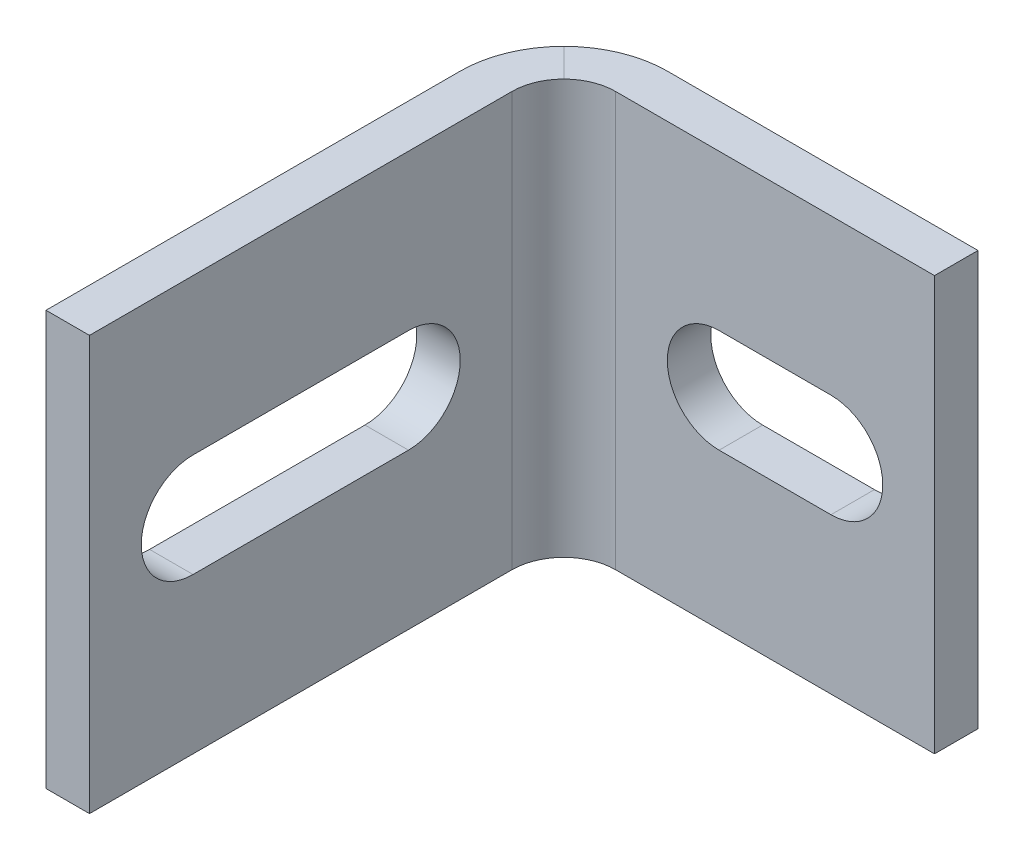
ISO-10303-21;
HEADER;
FILE_DESCRIPTION(('STEP AP214'),'2;1');
FILE_NAME('part.step','',(''),(''),'','','');
FILE_SCHEMA(('AUTOMOTIVE_DESIGN { 1 0 10303 214 1 1 1 1 }'));
ENDSEC;
DATA;
#1=APPLICATION_CONTEXT('core data for automotive mechanical design processes');
#2=APPLICATION_PROTOCOL_DEFINITION('international standard','automotive_design',2000,#1);
#3=PRODUCT_CONTEXT('',#1,'mechanical');
#4=PRODUCT('Part','Part','',(#3));
#5=PRODUCT_RELATED_PRODUCT_CATEGORY('part','',(#4));
#6=PRODUCT_DEFINITION_FORMATION('','',#4);
#7=PRODUCT_DEFINITION_CONTEXT('part definition',#1,'design');
#8=PRODUCT_DEFINITION('design','',#6,#7);
#9=PRODUCT_DEFINITION_SHAPE('','',#8);
#10=(LENGTH_UNIT() NAMED_UNIT(*) SI_UNIT(.MILLI.,.METRE.));
#11=(NAMED_UNIT(*) PLANE_ANGLE_UNIT() SI_UNIT($,.RADIAN.));
#12=(NAMED_UNIT(*) SI_UNIT($,.STERADIAN.) SOLID_ANGLE_UNIT());
#13=UNCERTAINTY_MEASURE_WITH_UNIT(LENGTH_MEASURE(1.E-05),#10,'distance_accuracy_value','');
#14=(GEOMETRIC_REPRESENTATION_CONTEXT(3) GLOBAL_UNCERTAINTY_ASSIGNED_CONTEXT((#13)) GLOBAL_UNIT_ASSIGNED_CONTEXT((#10,
#11,#12)) REPRESENTATION_CONTEXT('',''));
#15=CARTESIAN_POINT('',(0.,0.,0.));
#16=DIRECTION('',(0.,0.,1.));
#17=DIRECTION('',(1.,0.,0.));
#18=AXIS2_PLACEMENT_3D('',#15,#16,#17);
#19=CARTESIAN_POINT('',(0.,-12.7,0.));
#20=DIRECTION('',(1.,0.,0.));
#21=DIRECTION('',(0.,1.,0.));
#22=AXIS2_PLACEMENT_3D('',#19,#20,#21);
#23=PLANE('',#22);
#24=DIRECTION('',(0.,0.,-1.));
#25=VECTOR('',#24,1.);
#26=CARTESIAN_POINT('',(0.,12.7,-1.11022302462516E-13));
#27=LINE('',#26,#25);
#28=CARTESIAN_POINT('',(0.,12.7,-1.11022302462516E-13));
#29=VERTEX_POINT('',#28);
#30=CARTESIAN_POINT('',(0.,12.7000000000001,-25.4000000000001));
#31=VERTEX_POINT('',#30);
#32=EDGE_CURVE('E234',#29,#31,#27,.T.);
#33=ORIENTED_EDGE('',*,*,#32,.T.);
#34=DIRECTION('',(0.,-1.,0.));
#35=VECTOR('',#34,1.);
#36=CARTESIAN_POINT('',(0.,-12.7,-25.4));
#37=LINE('',#36,#35);
#38=CARTESIAN_POINT('',(0.,-12.7,-25.4));
#39=VERTEX_POINT('',#38);
#40=EDGE_CURVE('E289',#31,#39,#37,.T.);
#41=ORIENTED_EDGE('',*,*,#40,.T.);
#42=DIRECTION('',(0.,0.,-1.));
#43=VECTOR('',#42,1.);
#44=CARTESIAN_POINT('',(0.,-12.7,0.));
#45=LINE('',#44,#43);
#46=CARTESIAN_POINT('',(0.,-12.7,0.));
#47=VERTEX_POINT('',#46);
#48=EDGE_CURVE('E231',#47,#39,#45,.T.);
#49=ORIENTED_EDGE('',*,*,#48,.F.);
#50=DIRECTION('',(0.,-1.,0.));
#51=VECTOR('',#50,1.);
#52=CARTESIAN_POINT('',(0.,-12.7,0.));
#53=LINE('',#52,#51);
#54=EDGE_CURVE('E229',#29,#47,#53,.T.);
#55=ORIENTED_EDGE('',*,*,#54,.F.);
#56=EDGE_LOOP('',(#33,#41,#49,#55));
#57=FACE_BOUND('',#56,.T.);
#58=CARTESIAN_POINT('',(0.,0.,-19.558));
#59=DIRECTION('',(1.,0.,0.));
#60=DIRECTION('',(0.,0.,-1.));
#61=AXIS2_PLACEMENT_3D('',#58,#59,#60);
#62=CIRCLE('',#61,3.175);
#63=CARTESIAN_POINT('',(0.,-3.17499999999998,-19.558));
#64=VERTEX_POINT('',#63);
#65=CARTESIAN_POINT('',(0.,3.17500000000001,-19.558));
#66=VERTEX_POINT('',#65);
#67=EDGE_CURVE('E201',#64,#66,#62,.T.);
#68=ORIENTED_EDGE('',*,*,#67,.T.);
#69=DIRECTION('',(0.,0.,1.));
#70=VECTOR('',#69,1.);
#71=CARTESIAN_POINT('',(0.,3.17500000000001,-19.558));
#72=LINE('',#71,#70);
#73=CARTESIAN_POINT('',(0.,3.17500000000001,-6.34999999999997));
#74=VERTEX_POINT('',#73);
#75=EDGE_CURVE('E204',#66,#74,#72,.T.);
#76=ORIENTED_EDGE('',*,*,#75,.T.);
#77=CARTESIAN_POINT('',(0.,0.,-6.34999999999997));
#78=DIRECTION('',(1.,0.,0.));
#79=DIRECTION('',(0.,0.,-1.));
#80=AXIS2_PLACEMENT_3D('',#77,#78,#79);
#81=CIRCLE('',#80,3.175);
#82=CARTESIAN_POINT('',(0.,-3.17499999999998,-6.34999999999997));
#83=VERTEX_POINT('',#82);
#84=EDGE_CURVE('E207',#74,#83,#81,.T.);
#85=ORIENTED_EDGE('',*,*,#84,.T.);
#86=DIRECTION('',(0.,0.,-1.));
#87=VECTOR('',#86,1.);
#88=CARTESIAN_POINT('',(0.,-3.17499999999998,-19.558));
#89=LINE('',#88,#87);
#90=EDGE_CURVE('E210',#83,#64,#89,.T.);
#91=ORIENTED_EDGE('',*,*,#90,.T.);
#92=EDGE_LOOP('',(#68,#76,#85,#91));
#93=FACE_BOUND('',#92,.T.);
#94=ADVANCED_FACE('F32',(#57,#93),#23,.F.);
#95=CARTESIAN_POINT('',(2.66699999999997,-12.7,0.));
#96=DIRECTION('',(-1.,0.,0.));
#97=DIRECTION('',(0.,-1.,0.));
#98=AXIS2_PLACEMENT_3D('',#95,#96,#97);
#99=PLANE('',#98);
#100=DIRECTION('',(0.,0.,-1.));
#101=VECTOR('',#100,1.);
#102=CARTESIAN_POINT('',(2.66699999999997,-12.7,0.));
#103=LINE('',#102,#101);
#104=CARTESIAN_POINT('',(2.66699999999997,-12.7,0.));
#105=VERTEX_POINT('',#104);
#106=CARTESIAN_POINT('',(2.66699999999997,-12.7,-25.908));
#107=VERTEX_POINT('',#106);
#108=EDGE_CURVE('E230',#105,#107,#103,.T.);
#109=ORIENTED_EDGE('',*,*,#108,.T.);
#110=DIRECTION('',(0.,-1.,0.));
#111=VECTOR('',#110,1.);
#112=CARTESIAN_POINT('',(2.66699999999997,12.7,-25.908));
#113=LINE('',#112,#111);
#114=CARTESIAN_POINT('',(2.66699999999997,12.7,-25.908));
#115=VERTEX_POINT('',#114);
#116=EDGE_CURVE('E277',#107,#115,#113,.F.);
#117=ORIENTED_EDGE('',*,*,#116,.T.);
#118=DIRECTION('',(0.,0.,-1.));
#119=VECTOR('',#118,1.);
#120=CARTESIAN_POINT('',(2.66699999999997,12.7,-1.11022302462516E-13));
#121=LINE('',#120,#119);
#122=CARTESIAN_POINT('',(2.66699999999997,12.7,-1.11022302462516E-13));
#123=VERTEX_POINT('',#122);
#124=EDGE_CURVE('E241',#123,#115,#121,.T.);
#125=ORIENTED_EDGE('',*,*,#124,.F.);
#126=DIRECTION('',(0.,1.,0.));
#127=VECTOR('',#126,1.);
#128=CARTESIAN_POINT('',(2.66699999999997,-12.7,0.));
#129=LINE('',#128,#127);
#130=EDGE_CURVE('E244',#105,#123,#129,.T.);
#131=ORIENTED_EDGE('',*,*,#130,.F.);
#132=EDGE_LOOP('',(#109,#117,#125,#131));
#133=FACE_BOUND('',#132,.T.);
#134=CARTESIAN_POINT('',(2.66699999999997,0.,-19.558));
#135=DIRECTION('',(-1.,0.,0.));
#136=DIRECTION('',(0.,-1.,0.));
#137=AXIS2_PLACEMENT_3D('',#134,#135,#136);
#138=CIRCLE('',#137,3.175);
#139=CARTESIAN_POINT('',(2.66699999999997,3.17500000000001,-19.558));
#140=VERTEX_POINT('',#139);
#141=CARTESIAN_POINT('',(2.66699999999997,-3.17499999999998,-19.558));
#142=VERTEX_POINT('',#141);
#143=EDGE_CURVE('E198',#140,#142,#138,.T.);
#144=ORIENTED_EDGE('',*,*,#143,.T.);
#145=DIRECTION('',(0.,0.,1.));
#146=VECTOR('',#145,1.);
#147=CARTESIAN_POINT('',(2.66699999999997,-3.17499999999998,-19.558));
#148=LINE('',#147,#146);
#149=CARTESIAN_POINT('',(2.66699999999997,-3.17499999999998,-6.34999999999997));
#150=VERTEX_POINT('',#149);
#151=EDGE_CURVE('E222',#142,#150,#148,.T.);
#152=ORIENTED_EDGE('',*,*,#151,.T.);
#153=CARTESIAN_POINT('',(2.66699999999997,0.,-6.34999999999997));
#154=DIRECTION('',(-1.,0.,0.));
#155=DIRECTION('',(0.,-1.,0.));
#156=AXIS2_PLACEMENT_3D('',#153,#154,#155);
#157=CIRCLE('',#156,3.175);
#158=CARTESIAN_POINT('',(2.66699999999997,3.17500000000001,-6.34999999999997));
#159=VERTEX_POINT('',#158);
#160=EDGE_CURVE('E189',#150,#159,#157,.T.);
#161=ORIENTED_EDGE('',*,*,#160,.T.);
#162=DIRECTION('',(0.,0.,-1.));
#163=VECTOR('',#162,1.);
#164=CARTESIAN_POINT('',(2.66699999999997,3.17500000000001,-19.558));
#165=LINE('',#164,#163);
#166=EDGE_CURVE('E195',#159,#140,#165,.T.);
#167=ORIENTED_EDGE('',*,*,#166,.T.);
#168=EDGE_LOOP('',(#144,#152,#161,#167));
#169=FACE_BOUND('',#168,.T.);
#170=ADVANCED_FACE('F340',(#133,#169),#99,.F.);
#171=CARTESIAN_POINT('',(25.4,0.,-31.7499999999999));
#172=DIRECTION('',(-1.,0.,0.));
#173=DIRECTION('',(0.,0.,1.));
#174=AXIS2_PLACEMENT_3D('',#171,#172,#173);
#175=PLANE('',#174);
#176=DIRECTION('',(0.,1.,0.));
#177=VECTOR('',#176,1.);
#178=CARTESIAN_POINT('',(25.4,-12.7000000000001,-29.0830000000001));
#179=LINE('',#178,#177);
#180=CARTESIAN_POINT('',(25.4,-12.7000000000001,-29.0830000000001));
#181=VERTEX_POINT('',#180);
#182=CARTESIAN_POINT('',(25.4,12.7,-29.0830000000001));
#183=VERTEX_POINT('',#182);
#184=EDGE_CURVE('E270',#181,#183,#179,.T.);
#185=ORIENTED_EDGE('',*,*,#184,.F.);
#186=DIRECTION('',(0.,0.,1.));
#187=VECTOR('',#186,1.);
#188=CARTESIAN_POINT('',(25.4,-12.7000000000001,-29.0830000000001));
#189=LINE('',#188,#187);
#190=CARTESIAN_POINT('',(25.4,-12.7,-31.7500000000001));
#191=VERTEX_POINT('',#190);
#192=EDGE_CURVE('E225',#191,#181,#189,.T.);
#193=ORIENTED_EDGE('',*,*,#192,.F.);
#194=DIRECTION('',(0.,-1.,0.));
#195=VECTOR('',#194,1.);
#196=CARTESIAN_POINT('',(25.4,-12.7,-31.7500000000001));
#197=LINE('',#196,#195);
#198=CARTESIAN_POINT('',(25.4,12.7,-31.7500000000001));
#199=VERTEX_POINT('',#198);
#200=EDGE_CURVE('E261',#199,#191,#197,.T.);
#201=ORIENTED_EDGE('',*,*,#200,.F.);
#202=DIRECTION('',(0.,0.,-1.));
#203=VECTOR('',#202,1.);
#204=CARTESIAN_POINT('',(25.4,12.7,-29.0830000000001));
#205=LINE('',#204,#203);
#206=EDGE_CURVE('E266',#183,#199,#205,.T.);
#207=ORIENTED_EDGE('',*,*,#206,.F.);
#208=EDGE_LOOP('',(#185,#193,#201,#207));
#209=FACE_BOUND('',#208,.T.);
#210=ADVANCED_FACE('F336',(#209),#175,.F.);
#211=CARTESIAN_POINT('',(0.,0.,0.));
#212=DIRECTION('',(0.,0.,1.));
#213=DIRECTION('',(1.,0.,0.));
#214=AXIS2_PLACEMENT_3D('',#211,#212,#213);
#215=PLANE('',#214);
#216=ORIENTED_EDGE('',*,*,#130,.T.);
#217=DIRECTION('',(-1.,0.,0.));
#218=VECTOR('',#217,1.);
#219=CARTESIAN_POINT('',(2.66699999999997,12.7,-1.11022302462516E-13));
#220=LINE('',#219,#218);
#221=EDGE_CURVE('E238',#123,#29,#220,.T.);
#222=ORIENTED_EDGE('',*,*,#221,.T.);
#223=ORIENTED_EDGE('',*,*,#54,.T.);
#224=DIRECTION('',(1.,0.,0.));
#225=VECTOR('',#224,1.);
#226=CARTESIAN_POINT('',(2.66699999999997,-12.7,0.));
#227=LINE('',#226,#225);
#228=EDGE_CURVE('E226',#47,#105,#227,.T.);
#229=ORIENTED_EDGE('',*,*,#228,.T.);
#230=EDGE_LOOP('',(#216,#222,#223,#229));
#231=FACE_BOUND('',#230,.T.);
#232=ADVANCED_FACE('F319',(#231),#215,.T.);
#233=CARTESIAN_POINT('',(0.,-12.7,-29.083));
#234=DIRECTION('',(0.,0.,-1.));
#235=DIRECTION('',(0.,1.,0.));
#236=AXIS2_PLACEMENT_3D('',#233,#234,#235);
#237=PLANE('',#236);
#238=DIRECTION('',(1.,0.,0.));
#239=VECTOR('',#238,1.);
#240=CARTESIAN_POINT('',(12.192,-3.17500000000007,-29.083));
#241=LINE('',#240,#239);
#242=CARTESIAN_POINT('',(12.192,-3.17500000000007,-29.083));
#243=VERTEX_POINT('',#242);
#244=CARTESIAN_POINT('',(19.05,-3.17500000000004,-29.083));
#245=VERTEX_POINT('',#244);
#246=EDGE_CURVE('E183',#243,#245,#241,.T.);
#247=ORIENTED_EDGE('',*,*,#246,.F.);
#248=CARTESIAN_POINT('',(12.192,0.,-29.083));
#249=DIRECTION('',(0.,0.,1.));
#250=DIRECTION('',(1.,0.,0.));
#251=AXIS2_PLACEMENT_3D('',#248,#249,#250);
#252=CIRCLE('',#251,3.175);
#253=CARTESIAN_POINT('',(12.192,3.17499999999996,-29.083));
#254=VERTEX_POINT('',#253);
#255=EDGE_CURVE('E47',#254,#243,#252,.T.);
#256=ORIENTED_EDGE('',*,*,#255,.F.);
#257=DIRECTION('',(-1.,0.,0.));
#258=VECTOR('',#257,1.);
#259=CARTESIAN_POINT('',(12.192,3.17499999999996,-29.083));
#260=LINE('',#259,#258);
#261=CARTESIAN_POINT('',(19.05,3.17499999999996,-29.083));
#262=VERTEX_POINT('',#261);
#263=EDGE_CURVE('E174',#262,#254,#260,.T.);
#264=ORIENTED_EDGE('',*,*,#263,.F.);
#265=CARTESIAN_POINT('',(19.05,0.,-29.083));
#266=DIRECTION('',(0.,0.,1.));
#267=DIRECTION('',(1.,0.,0.));
#268=AXIS2_PLACEMENT_3D('',#265,#266,#267);
#269=CIRCLE('',#268,3.175);
#270=EDGE_CURVE('E177',#245,#262,#269,.T.);
#271=ORIENTED_EDGE('',*,*,#270,.F.);
#272=EDGE_LOOP('',(#247,#256,#264,#271));
#273=FACE_BOUND('',#272,.T.);
#274=DIRECTION('',(1.,0.,0.));
#275=VECTOR('',#274,1.);
#276=CARTESIAN_POINT('',(0.,12.7,-29.0830000000001));
#277=LINE('',#276,#275);
#278=CARTESIAN_POINT('',(5.84200000000001,12.7000000000001,-29.0830000000001));
#279=VERTEX_POINT('',#278);
#280=EDGE_CURVE('E269',#279,#183,#277,.T.);
#281=ORIENTED_EDGE('',*,*,#280,.F.);
#282=DIRECTION('',(0.,-1.,0.));
#283=VECTOR('',#282,1.);
#284=CARTESIAN_POINT('',(5.84200000000001,-12.7,-29.0830000000001));
#285=LINE('',#284,#283);
#286=CARTESIAN_POINT('',(5.84200000000001,-12.7,-29.0830000000001));
#287=VERTEX_POINT('',#286);
#288=EDGE_CURVE('E247',#279,#287,#285,.T.);
#289=ORIENTED_EDGE('',*,*,#288,.T.);
#290=DIRECTION('',(1.,0.,0.));
#291=VECTOR('',#290,1.);
#292=CARTESIAN_POINT('',(0.,-12.7,-29.083));
#293=LINE('',#292,#291);
#294=EDGE_CURVE('E252',#287,#181,#293,.T.);
#295=ORIENTED_EDGE('',*,*,#294,.T.);
#296=ORIENTED_EDGE('',*,*,#184,.T.);
#297=EDGE_LOOP('',(#281,#289,#295,#296));
#298=FACE_BOUND('',#297,.T.);
#299=ADVANCED_FACE('F329',(#273,#298),#237,.F.);
#300=CARTESIAN_POINT('',(0.,12.7,-29.0830000000001));
#301=DIRECTION('',(0.,-1.,0.));
#302=DIRECTION('',(0.,0.,-1.));
#303=AXIS2_PLACEMENT_3D('',#300,#301,#302);
#304=PLANE('',#303);
#305=DIRECTION('',(1.,0.,0.));
#306=VECTOR('',#305,1.);
#307=CARTESIAN_POINT('',(0.,12.7000000000001,-31.7500000000001));
#308=LINE('',#307,#306);
#309=CARTESIAN_POINT('',(6.34999999999997,12.7000000000001,-31.7500000000001));
#310=VERTEX_POINT('',#309);
#311=EDGE_CURVE('E264',#310,#199,#308,.T.);
#312=ORIENTED_EDGE('',*,*,#311,.F.);
#313=CARTESIAN_POINT('',(6.34999999999997,12.7000000000001,-25.4000000000001));
#314=DIRECTION('',(0.,-1.,0.));
#315=DIRECTION('',(0.,0.,-1.));
#316=AXIS2_PLACEMENT_3D('',#313,#314,#315);
#317=CIRCLE('',#316,6.35);
#318=CARTESIAN_POINT('',(1.85987193946546,12.7000000000001,-29.8901280605347));
#319=VERTEX_POINT('',#318);
#320=EDGE_CURVE('E40',#310,#319,#317,.F.);
#321=ORIENTED_EDGE('',*,*,#320,.T.);
#322=DIRECTION('',(0.707106781186548,0.,0.707106781186548));
#323=VECTOR('',#322,1.);
#324=CARTESIAN_POINT('',(17.2085,12.7,-14.5415000000001));
#325=LINE('',#324,#323);
#326=CARTESIAN_POINT('',(3.59693596973265,12.7,-28.1530640302674));
#327=VERTEX_POINT('',#326);
#328=EDGE_CURVE('E235',#319,#327,#325,.T.);
#329=ORIENTED_EDGE('',*,*,#328,.T.);
#330=CARTESIAN_POINT('',(5.84200000000001,12.7,-25.908));
#331=DIRECTION('',(0.,-1.,0.));
#332=DIRECTION('',(0.,0.,-1.));
#333=AXIS2_PLACEMENT_3D('',#330,#331,#332);
#334=CIRCLE('',#333,3.175);
#335=EDGE_CURVE('E287',#327,#279,#334,.T.);
#336=ORIENTED_EDGE('',*,*,#335,.T.);
#337=ORIENTED_EDGE('',*,*,#280,.T.);
#338=ORIENTED_EDGE('',*,*,#206,.T.);
#339=EDGE_LOOP('',(#312,#321,#329,#336,#337,#338));
#340=FACE_BOUND('',#339,.T.);
#341=ADVANCED_FACE('F301',(#340),#304,.F.);
#342=CARTESIAN_POINT('',(0.,-12.7,-31.7500000000001));
#343=DIRECTION('',(0.,0.,1.));
#344=DIRECTION('',(0.,-1.,0.));
#345=AXIS2_PLACEMENT_3D('',#342,#343,#344);
#346=PLANE('',#345);
#347=DIRECTION('',(-1.,0.,0.));
#348=VECTOR('',#347,1.);
#349=CARTESIAN_POINT('',(12.192,3.17499999999998,-31.7499999999999));
#350=LINE('',#349,#348);
#351=CARTESIAN_POINT('',(19.05,3.17499999999998,-31.7499999999999));
#352=VERTEX_POINT('',#351);
#353=CARTESIAN_POINT('',(12.192,3.17499999999998,-31.7499999999999));
#354=VERTEX_POINT('',#353);
#355=EDGE_CURVE('E164',#352,#354,#350,.T.);
#356=ORIENTED_EDGE('',*,*,#355,.T.);
#357=CARTESIAN_POINT('',(12.192,0.,-31.7500000000001));
#358=DIRECTION('',(0.,0.,1.));
#359=DIRECTION('',(1.,0.,0.));
#360=AXIS2_PLACEMENT_3D('',#357,#358,#359);
#361=CIRCLE('',#360,3.175);
#362=CARTESIAN_POINT('',(12.192,-3.17500000000004,-31.7500000000001));
#363=VERTEX_POINT('',#362);
#364=EDGE_CURVE('E158',#354,#363,#361,.T.);
#365=ORIENTED_EDGE('',*,*,#364,.T.);
#366=DIRECTION('',(1.,0.,0.));
#367=VECTOR('',#366,1.);
#368=CARTESIAN_POINT('',(12.192,-3.17500000000004,-31.7500000000001));
#369=LINE('',#368,#367);
#370=CARTESIAN_POINT('',(19.05,-3.17500000000001,-31.7500000000001));
#371=VERTEX_POINT('',#370);
#372=EDGE_CURVE('E167',#363,#371,#369,.T.);
#373=ORIENTED_EDGE('',*,*,#372,.T.);
#374=CARTESIAN_POINT('',(19.05,0.,-31.7500000000001));
#375=DIRECTION('',(0.,0.,1.));
#376=DIRECTION('',(1.,0.,0.));
#377=AXIS2_PLACEMENT_3D('',#374,#375,#376);
#378=CIRCLE('',#377,3.175);
#379=EDGE_CURVE('E55',#371,#352,#378,.T.);
#380=ORIENTED_EDGE('',*,*,#379,.T.);
#381=EDGE_LOOP('',(#356,#365,#373,#380));
#382=FACE_BOUND('',#381,.T.);
#383=DIRECTION('',(1.,0.,0.));
#384=VECTOR('',#383,1.);
#385=CARTESIAN_POINT('',(0.,-12.7,-31.7500000000001));
#386=LINE('',#385,#384);
#387=CARTESIAN_POINT('',(6.34999999999997,-12.7,-31.7500000000001));
#388=VERTEX_POINT('',#387);
#389=EDGE_CURVE('E259',#388,#191,#386,.T.);
#390=ORIENTED_EDGE('',*,*,#389,.F.);
#391=DIRECTION('',(0.,-1.,0.));
#392=VECTOR('',#391,1.);
#393=CARTESIAN_POINT('',(6.34999999999997,-12.7,-31.7500000000001));
#394=LINE('',#393,#392);
#395=EDGE_CURVE('E296',#388,#310,#394,.F.);
#396=ORIENTED_EDGE('',*,*,#395,.T.);
#397=ORIENTED_EDGE('',*,*,#311,.T.);
#398=ORIENTED_EDGE('',*,*,#200,.T.);
#399=EDGE_LOOP('',(#390,#396,#397,#398));
#400=FACE_BOUND('',#399,.T.);
#401=ADVANCED_FACE('F171',(#382,#400),#346,.F.);
#402=CARTESIAN_POINT('',(0.,-12.7,-29.083));
#403=DIRECTION('',(0.,1.,0.));
#404=DIRECTION('',(0.,0.,1.));
#405=AXIS2_PLACEMENT_3D('',#402,#403,#404);
#406=PLANE('',#405);
#407=DIRECTION('',(-0.707106781186548,0.,-0.707106781186548));
#408=VECTOR('',#407,1.);
#409=CARTESIAN_POINT('',(17.2085,-12.7000000000001,-14.5415));
#410=LINE('',#409,#408);
#411=CARTESIAN_POINT('',(3.59693596973276,-12.7,-28.1530640302673));
#412=VERTEX_POINT('',#411);
#413=CARTESIAN_POINT('',(1.85987193946546,-12.7,-29.8901280605346));
#414=VERTEX_POINT('',#413);
#415=EDGE_CURVE('E249',#412,#414,#410,.T.);
#416=ORIENTED_EDGE('',*,*,#415,.T.);
#417=CARTESIAN_POINT('',(6.34999999999997,-12.7,-25.4));
#418=DIRECTION('',(0.,1.,0.));
#419=DIRECTION('',(0.,0.,1.));
#420=AXIS2_PLACEMENT_3D('',#417,#418,#419);
#421=CIRCLE('',#420,6.35);
#422=EDGE_CURVE('E294',#414,#388,#421,.F.);
#423=ORIENTED_EDGE('',*,*,#422,.T.);
#424=ORIENTED_EDGE('',*,*,#389,.T.);
#425=ORIENTED_EDGE('',*,*,#192,.T.);
#426=ORIENTED_EDGE('',*,*,#294,.F.);
#427=CARTESIAN_POINT('',(5.84200000000001,-12.7,-25.908));
#428=DIRECTION('',(0.,1.,0.));
#429=DIRECTION('',(0.,0.,1.));
#430=AXIS2_PLACEMENT_3D('',#427,#428,#429);
#431=CIRCLE('',#430,3.175);
#432=EDGE_CURVE('E279',#287,#412,#431,.T.);
#433=ORIENTED_EDGE('',*,*,#432,.T.);
#434=EDGE_LOOP('',(#416,#423,#424,#425,#426,#433));
#435=FACE_BOUND('',#434,.T.);
#436=ADVANCED_FACE('F339',(#435),#406,.F.);
#437=CARTESIAN_POINT('',(2.66699999999997,12.7,-1.11022302462516E-13));
#438=DIRECTION('',(0.,-1.,0.));
#439=DIRECTION('',(0.,0.,-1.));
#440=AXIS2_PLACEMENT_3D('',#437,#438,#439);
#441=PLANE('',#440);
#442=ORIENTED_EDGE('',*,*,#328,.F.);
#443=CARTESIAN_POINT('',(6.34999999999997,12.7000000000001,-25.4000000000001));
#444=DIRECTION('',(0.,-1.,0.));
#445=DIRECTION('',(0.,0.,-1.));
#446=AXIS2_PLACEMENT_3D('',#443,#444,#445);
#447=CIRCLE('',#446,6.35);
#448=EDGE_CURVE('E11',#319,#31,#447,.F.);
#449=ORIENTED_EDGE('',*,*,#448,.T.);
#450=ORIENTED_EDGE('',*,*,#32,.F.);
#451=ORIENTED_EDGE('',*,*,#221,.F.);
#452=ORIENTED_EDGE('',*,*,#124,.T.);
#453=CARTESIAN_POINT('',(5.84200000000001,12.7,-25.908));
#454=DIRECTION('',(0.,-1.,0.));
#455=DIRECTION('',(0.,0.,-1.));
#456=AXIS2_PLACEMENT_3D('',#453,#454,#455);
#457=CIRCLE('',#456,3.175);
#458=EDGE_CURVE('E284',#115,#327,#457,.T.);
#459=ORIENTED_EDGE('',*,*,#458,.T.);
#460=EDGE_LOOP('',(#442,#449,#450,#451,#452,#459));
#461=FACE_BOUND('',#460,.T.);
#462=ADVANCED_FACE('F306',(#461),#441,.F.);
#463=CARTESIAN_POINT('',(2.66699999999997,-12.7,0.));
#464=DIRECTION('',(0.,1.,0.));
#465=DIRECTION('',(0.,0.,1.));
#466=AXIS2_PLACEMENT_3D('',#463,#464,#465);
#467=PLANE('',#466);
#468=ORIENTED_EDGE('',*,*,#48,.T.);
#469=CARTESIAN_POINT('',(6.34999999999997,-12.7,-25.4));
#470=DIRECTION('',(0.,1.,0.));
#471=DIRECTION('',(0.,0.,1.));
#472=AXIS2_PLACEMENT_3D('',#469,#470,#471);
#473=CIRCLE('',#472,6.35);
#474=EDGE_CURVE('E292',#39,#414,#473,.F.);
#475=ORIENTED_EDGE('',*,*,#474,.T.);
#476=ORIENTED_EDGE('',*,*,#415,.F.);
#477=CARTESIAN_POINT('',(5.84200000000001,-12.7,-25.908));
#478=DIRECTION('',(0.,1.,0.));
#479=DIRECTION('',(0.,0.,1.));
#480=AXIS2_PLACEMENT_3D('',#477,#478,#479);
#481=CIRCLE('',#480,3.175);
#482=EDGE_CURVE('E282',#412,#107,#481,.T.);
#483=ORIENTED_EDGE('',*,*,#482,.T.);
#484=ORIENTED_EDGE('',*,*,#108,.F.);
#485=ORIENTED_EDGE('',*,*,#228,.F.);
#486=EDGE_LOOP('',(#468,#475,#476,#483,#484,#485));
#487=FACE_BOUND('',#486,.T.);
#488=ADVANCED_FACE('F316',(#487),#467,.F.);
#489=CARTESIAN_POINT('',(5.84200000000001,-12.7,-25.908));
#490=DIRECTION('',(0.,1.,0.));
#491=DIRECTION('',(0.,0.,1.));
#492=AXIS2_PLACEMENT_3D('',#489,#490,#491);
#493=CYLINDRICAL_SURFACE('',#492,3.175);
#494=ORIENTED_EDGE('',*,*,#458,.F.);
#495=ORIENTED_EDGE('',*,*,#116,.F.);
#496=ORIENTED_EDGE('',*,*,#482,.F.);
#497=ORIENTED_EDGE('',*,*,#432,.F.);
#498=ORIENTED_EDGE('',*,*,#288,.F.);
#499=ORIENTED_EDGE('',*,*,#335,.F.);
#500=EDGE_LOOP('',(#494,#495,#496,#497,#498,#499));
#501=FACE_BOUND('',#500,.T.);
#502=ADVANCED_FACE('F324',(#501),#493,.F.);
#503=CARTESIAN_POINT('',(6.34999999999997,-12.7,-25.4));
#504=DIRECTION('',(0.,-1.,0.));
#505=DIRECTION('',(0.,0.,-1.));
#506=AXIS2_PLACEMENT_3D('',#503,#504,#505);
#507=CYLINDRICAL_SURFACE('',#506,6.35);
#508=ORIENTED_EDGE('',*,*,#320,.F.);
#509=ORIENTED_EDGE('',*,*,#395,.F.);
#510=ORIENTED_EDGE('',*,*,#422,.F.);
#511=ORIENTED_EDGE('',*,*,#474,.F.);
#512=ORIENTED_EDGE('',*,*,#40,.F.);
#513=ORIENTED_EDGE('',*,*,#448,.F.);
#514=EDGE_LOOP('',(#508,#509,#510,#511,#512,#513));
#515=FACE_BOUND('',#514,.T.);
#516=ADVANCED_FACE('F34',(#515),#507,.T.);
#517=CARTESIAN_POINT('',(25.401,0.,-19.558));
#518=DIRECTION('',(-1.,0.,0.));
#519=DIRECTION('',(0.,0.,1.));
#520=AXIS2_PLACEMENT_3D('',#517,#518,#519);
#521=CYLINDRICAL_SURFACE('',#520,3.175);
#522=DIRECTION('',(-1.,0.,0.));
#523=VECTOR('',#522,1.);
#524=CARTESIAN_POINT('',(25.401,3.17499999999998,-19.558));
#525=LINE('',#524,#523);
#526=EDGE_CURVE('E220',#140,#66,#525,.T.);
#527=ORIENTED_EDGE('',*,*,#526,.T.);
#528=ORIENTED_EDGE('',*,*,#67,.F.);
#529=DIRECTION('',(-1.,0.,0.));
#530=VECTOR('',#529,1.);
#531=CARTESIAN_POINT('',(25.401,-3.17500000000001,-19.558));
#532=LINE('',#531,#530);
#533=EDGE_CURVE('E213',#142,#64,#532,.T.);
#534=ORIENTED_EDGE('',*,*,#533,.F.);
#535=ORIENTED_EDGE('',*,*,#143,.F.);
#536=EDGE_LOOP('',(#527,#528,#534,#535));
#537=FACE_BOUND('',#536,.T.);
#538=ADVANCED_FACE('F347',(#537),#521,.F.);
#539=CARTESIAN_POINT('',(25.401,3.17499999999998,-19.558));
#540=DIRECTION('',(0.,-1.,0.));
#541=DIRECTION('',(0.,0.,-1.));
#542=AXIS2_PLACEMENT_3D('',#539,#540,#541);
#543=PLANE('',#542);
#544=DIRECTION('',(-1.,0.,0.));
#545=VECTOR('',#544,1.);
#546=CARTESIAN_POINT('',(25.401,3.17499999999998,-6.34999999999997));
#547=LINE('',#546,#545);
#548=EDGE_CURVE('E218',#159,#74,#547,.T.);
#549=ORIENTED_EDGE('',*,*,#548,.T.);
#550=ORIENTED_EDGE('',*,*,#75,.F.);
#551=ORIENTED_EDGE('',*,*,#526,.F.);
#552=ORIENTED_EDGE('',*,*,#166,.F.);
#553=EDGE_LOOP('',(#549,#550,#551,#552));
#554=FACE_BOUND('',#553,.T.);
#555=ADVANCED_FACE('F350',(#554),#543,.T.);
#556=CARTESIAN_POINT('',(25.401,0.,-6.34999999999997));
#557=DIRECTION('',(-1.,0.,0.));
#558=DIRECTION('',(0.,0.,1.));
#559=AXIS2_PLACEMENT_3D('',#556,#557,#558);
#560=CYLINDRICAL_SURFACE('',#559,3.175);
#561=DIRECTION('',(-1.,0.,0.));
#562=VECTOR('',#561,1.);
#563=CARTESIAN_POINT('',(25.401,-3.17500000000004,-6.34999999999997));
#564=LINE('',#563,#562);
#565=EDGE_CURVE('E216',#150,#83,#564,.T.);
#566=ORIENTED_EDGE('',*,*,#565,.T.);
#567=ORIENTED_EDGE('',*,*,#84,.F.);
#568=ORIENTED_EDGE('',*,*,#548,.F.);
#569=ORIENTED_EDGE('',*,*,#160,.F.);
#570=EDGE_LOOP('',(#566,#567,#568,#569));
#571=FACE_BOUND('',#570,.T.);
#572=ADVANCED_FACE('F358',(#571),#560,.F.);
#573=CARTESIAN_POINT('',(25.401,-3.17500000000001,-19.558));
#574=DIRECTION('',(0.,1.,0.));
#575=DIRECTION('',(0.,0.,1.));
#576=AXIS2_PLACEMENT_3D('',#573,#574,#575);
#577=PLANE('',#576);
#578=ORIENTED_EDGE('',*,*,#533,.T.);
#579=ORIENTED_EDGE('',*,*,#90,.F.);
#580=ORIENTED_EDGE('',*,*,#565,.F.);
#581=ORIENTED_EDGE('',*,*,#151,.F.);
#582=EDGE_LOOP('',(#578,#579,#580,#581));
#583=FACE_BOUND('',#582,.T.);
#584=ADVANCED_FACE('F355',(#583),#577,.T.);
#585=CARTESIAN_POINT('',(12.192,0.,-31.7500000000001));
#586=DIRECTION('',(0.,0.,1.));
#587=DIRECTION('',(1.,0.,0.));
#588=AXIS2_PLACEMENT_3D('',#585,#586,#587);
#589=CYLINDRICAL_SURFACE('',#588,3.175);
#590=ORIENTED_EDGE('',*,*,#255,.T.);
#591=DIRECTION('',(0.,0.,1.));
#592=VECTOR('',#591,1.);
#593=CARTESIAN_POINT('',(12.192,-3.17500000000004,-31.7500000000001));
#594=LINE('',#593,#592);
#595=EDGE_CURVE('E154',#363,#243,#594,.T.);
#596=ORIENTED_EDGE('',*,*,#595,.F.);
#597=ORIENTED_EDGE('',*,*,#364,.F.);
#598=DIRECTION('',(0.,0.,1.));
#599=VECTOR('',#598,1.);
#600=CARTESIAN_POINT('',(12.192,3.17499999999998,-31.7499999999999));
#601=LINE('',#600,#599);
#602=EDGE_CURVE('E187',#354,#254,#601,.T.);
#603=ORIENTED_EDGE('',*,*,#602,.T.);
#604=EDGE_LOOP('',(#590,#596,#597,#603));
#605=FACE_BOUND('',#604,.T.);
#606=ADVANCED_FACE('F156',(#605),#589,.F.);
#607=CARTESIAN_POINT('',(12.192,3.17499999999998,-31.7499999999999));
#608=DIRECTION('',(0.,1.,0.));
#609=DIRECTION('',(-1.,0.,0.));
#610=AXIS2_PLACEMENT_3D('',#607,#608,#609);
#611=PLANE('',#610);
#612=ORIENTED_EDGE('',*,*,#263,.T.);
#613=ORIENTED_EDGE('',*,*,#602,.F.);
#614=ORIENTED_EDGE('',*,*,#355,.F.);
#615=DIRECTION('',(0.,0.,1.));
#616=VECTOR('',#615,1.);
#617=CARTESIAN_POINT('',(19.05,3.17499999999998,-31.7499999999999));
#618=LINE('',#617,#616);
#619=EDGE_CURVE('E190',#352,#262,#618,.T.);
#620=ORIENTED_EDGE('',*,*,#619,.T.);
#621=EDGE_LOOP('',(#612,#613,#614,#620));
#622=FACE_BOUND('',#621,.T.);
#623=ADVANCED_FACE('F415',(#622),#611,.F.);
#624=CARTESIAN_POINT('',(19.05,0.,-31.7500000000001));
#625=DIRECTION('',(0.,0.,1.));
#626=DIRECTION('',(1.,0.,0.));
#627=AXIS2_PLACEMENT_3D('',#624,#625,#626);
#628=CYLINDRICAL_SURFACE('',#627,3.175);
#629=ORIENTED_EDGE('',*,*,#270,.T.);
#630=ORIENTED_EDGE('',*,*,#619,.F.);
#631=ORIENTED_EDGE('',*,*,#379,.F.);
#632=DIRECTION('',(0.,0.,1.));
#633=VECTOR('',#632,1.);
#634=CARTESIAN_POINT('',(19.05,-3.17500000000001,-31.7500000000001));
#635=LINE('',#634,#633);
#636=EDGE_CURVE('E163',#371,#245,#635,.T.);
#637=ORIENTED_EDGE('',*,*,#636,.T.);
#638=EDGE_LOOP('',(#629,#630,#631,#637));
#639=FACE_BOUND('',#638,.T.);
#640=ADVANCED_FACE('F422',(#639),#628,.F.);
#641=CARTESIAN_POINT('',(12.192,-3.17500000000004,-31.7500000000001));
#642=DIRECTION('',(0.,-1.,0.));
#643=DIRECTION('',(1.,0.,0.));
#644=AXIS2_PLACEMENT_3D('',#641,#642,#643);
#645=PLANE('',#644);
#646=ORIENTED_EDGE('',*,*,#246,.T.);
#647=ORIENTED_EDGE('',*,*,#636,.F.);
#648=ORIENTED_EDGE('',*,*,#372,.F.);
#649=ORIENTED_EDGE('',*,*,#595,.T.);
#650=EDGE_LOOP('',(#646,#647,#648,#649));
#651=FACE_BOUND('',#650,.T.);
#652=ADVANCED_FACE('F168',(#651),#645,.F.);
#653=CLOSED_SHELL('',(#94,#170,#210,#232,#299,#341,#401,#436,#462,#488,#502,#516,#538,#555,#572,
#584,#606,#623,#640,#652));
#654=MANIFOLD_SOLID_BREP('B2',#653);
#655=ADVANCED_BREP_SHAPE_REPRESENTATION('',(#18,#654),#14);
#656=SHAPE_DEFINITION_REPRESENTATION(#9,#655);
ENDSEC;
END-ISO-10303-21;
